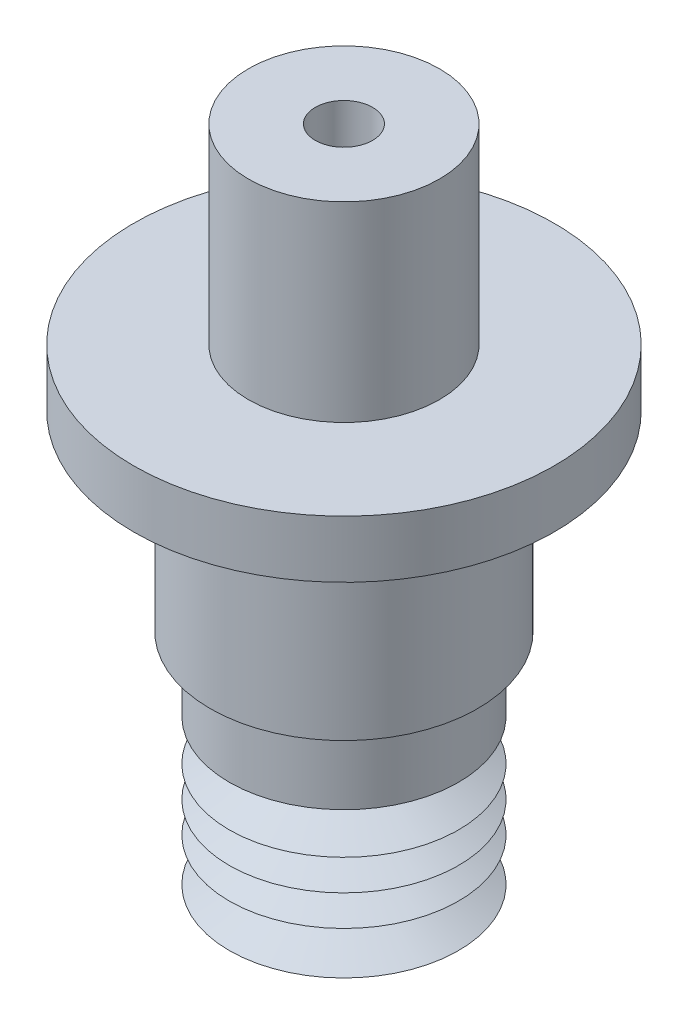
ISO-10303-21;
HEADER;
FILE_DESCRIPTION(('STEP AP214'),'2;1');
FILE_NAME('part.step','',(''),(''),'','','');
FILE_SCHEMA(('AUTOMOTIVE_DESIGN { 1 0 10303 214 1 1 1 1 }'));
ENDSEC;
DATA;
#1=APPLICATION_CONTEXT('core data for automotive mechanical design processes');
#2=APPLICATION_PROTOCOL_DEFINITION('international standard','automotive_design',2000,#1);
#3=PRODUCT_CONTEXT('',#1,'mechanical');
#4=PRODUCT('Part','Part','',(#3));
#5=PRODUCT_RELATED_PRODUCT_CATEGORY('part','',(#4));
#6=PRODUCT_DEFINITION_FORMATION('','',#4);
#7=PRODUCT_DEFINITION_CONTEXT('part definition',#1,'design');
#8=PRODUCT_DEFINITION('design','',#6,#7);
#9=PRODUCT_DEFINITION_SHAPE('','',#8);
#10=(LENGTH_UNIT() NAMED_UNIT(*) SI_UNIT(.MILLI.,.METRE.));
#11=(NAMED_UNIT(*) PLANE_ANGLE_UNIT() SI_UNIT($,.RADIAN.));
#12=(NAMED_UNIT(*) SI_UNIT($,.STERADIAN.) SOLID_ANGLE_UNIT());
#13=UNCERTAINTY_MEASURE_WITH_UNIT(LENGTH_MEASURE(1.E-05),#10,'distance_accuracy_value','');
#14=(GEOMETRIC_REPRESENTATION_CONTEXT(3) GLOBAL_UNCERTAINTY_ASSIGNED_CONTEXT((#13)) GLOBAL_UNIT_ASSIGNED_CONTEXT((#10,
#11,#12)) REPRESENTATION_CONTEXT('',''));
#15=CARTESIAN_POINT('',(0.,0.,0.));
#16=DIRECTION('',(0.,0.,1.));
#17=DIRECTION('',(1.,0.,0.));
#18=AXIS2_PLACEMENT_3D('',#15,#16,#17);
#19=CARTESIAN_POINT('',(0.,-3.06123305752487,0.));
#20=DIRECTION('',(0.,-1.,0.));
#21=DIRECTION('',(0.,0.,-1.));
#22=AXIS2_PLACEMENT_3D('',#19,#20,#21);
#23=CONICAL_SURFACE('',#22,4.06143498969451,1.11982088644156);
#24=CARTESIAN_POINT('',(0.,-3.99999999999068,0.));
#25=DIRECTION('',(0.,1.,0.));
#26=DIRECTION('',(0.,0.,1.));
#27=AXIS2_PLACEMENT_3D('',#24,#25,#26);
#28=CIRCLE('',#27,6.0000000000382);
#29=CARTESIAN_POINT('',(0.,-3.99999999999068,6.0000000000382));
#30=VERTEX_POINT('',#29);
#31=EDGE_CURVE('E60',#30,#30,#28,.T.);
#32=ORIENTED_EDGE('',*,*,#31,.T.);
#33=EDGE_LOOP('',(#32));
#34=FACE_BOUND('',#33,.T.);
#35=CARTESIAN_POINT('',(0.,-3.06123305752487,0.));
#36=DIRECTION('',(0.,1.,0.));
#37=DIRECTION('',(0.,0.,1.));
#38=AXIS2_PLACEMENT_3D('',#35,#36,#37);
#39=CIRCLE('',#38,4.06143498969451);
#40=CARTESIAN_POINT('',(0.,-3.06123305752487,4.06143498969451));
#41=VERTEX_POINT('',#40);
#42=EDGE_CURVE('E34',#41,#41,#39,.T.);
#43=ORIENTED_EDGE('',*,*,#42,.F.);
#44=EDGE_LOOP('',(#43));
#45=FACE_BOUND('',#44,.T.);
#46=ADVANCED_FACE('F31',(#34,#45),#23,.T.);
#47=CARTESIAN_POINT('',(0.,-1.75610447428198,0.));
#48=DIRECTION('',(0.,1.,0.));
#49=DIRECTION('',(0.,0.,1.));
#50=AXIS2_PLACEMENT_3D('',#47,#48,#49);
#51=CONICAL_SURFACE('',#50,6.0000000000382,0.978253528230279);
#52=ORIENTED_EDGE('',*,*,#42,.T.);
#53=EDGE_LOOP('',(#52));
#54=FACE_BOUND('',#53,.T.);
#55=CARTESIAN_POINT('',(0.,-1.75610447428198,0.));
#56=DIRECTION('',(0.,1.,0.));
#57=DIRECTION('',(0.,0.,1.));
#58=AXIS2_PLACEMENT_3D('',#55,#56,#57);
#59=CIRCLE('',#58,6.0000000000382);
#60=CARTESIAN_POINT('',(0.,-1.75610447428198,6.0000000000382));
#61=VERTEX_POINT('',#60);
#62=EDGE_CURVE('E42',#61,#61,#59,.T.);
#63=ORIENTED_EDGE('',*,*,#62,.F.);
#64=EDGE_LOOP('',(#63));
#65=FACE_BOUND('',#64,.T.);
#66=ADVANCED_FACE('F124',(#54,#65),#51,.T.);
#67=CARTESIAN_POINT('',(0.,-0.817337531841333,0.));
#68=DIRECTION('',(0.,-1.,0.));
#69=DIRECTION('',(0.,0.,-1.));
#70=AXIS2_PLACEMENT_3D('',#67,#68,#69);
#71=CONICAL_SURFACE('',#70,4.06143498969451,1.11982088645207);
#72=ORIENTED_EDGE('',*,*,#62,.T.);
#73=EDGE_LOOP('',(#72));
#74=FACE_BOUND('',#73,.T.);
#75=CARTESIAN_POINT('',(0.,-0.817337531841333,0.));
#76=DIRECTION('',(0.,1.,0.));
#77=DIRECTION('',(0.,0.,1.));
#78=AXIS2_PLACEMENT_3D('',#75,#76,#77);
#79=CIRCLE('',#78,4.06143498969451);
#80=CARTESIAN_POINT('',(0.,-0.817337531841333,4.06143498969451));
#81=VERTEX_POINT('',#80);
#82=EDGE_CURVE('E116',#81,#81,#79,.T.);
#83=ORIENTED_EDGE('',*,*,#82,.F.);
#84=EDGE_LOOP('',(#83));
#85=FACE_BOUND('',#84,.T.);
#86=ADVANCED_FACE('F121',(#74,#85),#71,.T.);
#87=CARTESIAN_POINT('',(0.,-0.143736576685401,0.));
#88=DIRECTION('',(0.,1.,0.));
#89=DIRECTION('',(0.,0.,1.));
#90=AXIS2_PLACEMENT_3D('',#87,#88,#89);
#91=CONICAL_SURFACE('',#90,6.0000000000382,1.23637360376424);
#92=ORIENTED_EDGE('',*,*,#82,.T.);
#93=EDGE_LOOP('',(#92));
#94=FACE_BOUND('',#93,.T.);
#95=CARTESIAN_POINT('',(0.,-0.143736576685401,0.));
#96=DIRECTION('',(0.,1.,0.));
#97=DIRECTION('',(0.,0.,1.));
#98=AXIS2_PLACEMENT_3D('',#95,#96,#97);
#99=CIRCLE('',#98,6.0000000000382);
#100=CARTESIAN_POINT('',(0.,-0.143736576685401,6.0000000000382));
#101=VERTEX_POINT('',#100);
#102=EDGE_CURVE('E113',#101,#101,#99,.T.);
#103=ORIENTED_EDGE('',*,*,#102,.F.);
#104=EDGE_LOOP('',(#103));
#105=FACE_BOUND('',#104,.T.);
#106=ADVANCED_FACE('F131',(#94,#105),#91,.T.);
#107=CARTESIAN_POINT('',(0.,0.795030365780429,0.));
#108=DIRECTION('',(0.,-1.,0.));
#109=DIRECTION('',(0.,0.,-1.));
#110=AXIS2_PLACEMENT_3D('',#107,#108,#109);
#111=CONICAL_SURFACE('',#110,4.06143498969451,1.11982088644155);
#112=ORIENTED_EDGE('',*,*,#102,.T.);
#113=EDGE_LOOP('',(#112));
#114=FACE_BOUND('',#113,.T.);
#115=CARTESIAN_POINT('',(0.,0.795030365780429,0.));
#116=DIRECTION('',(0.,1.,0.));
#117=DIRECTION('',(0.,0.,1.));
#118=AXIS2_PLACEMENT_3D('',#115,#116,#117);
#119=CIRCLE('',#118,4.06143498969451);
#120=CARTESIAN_POINT('',(0.,0.795030365780429,4.06143498969451));
#121=VERTEX_POINT('',#120);
#122=EDGE_CURVE('E110',#121,#121,#119,.T.);
#123=ORIENTED_EDGE('',*,*,#122,.F.);
#124=EDGE_LOOP('',(#123));
#125=FACE_BOUND('',#124,.T.);
#126=ADVANCED_FACE('F137',(#114,#125),#111,.T.);
#127=CARTESIAN_POINT('',(0.,1.46863132093602,0.));
#128=DIRECTION('',(0.,1.,0.));
#129=DIRECTION('',(0.,0.,1.));
#130=AXIS2_PLACEMENT_3D('',#127,#128,#129);
#131=CONICAL_SURFACE('',#130,6.0000000000382,1.2363736037644);
#132=ORIENTED_EDGE('',*,*,#122,.T.);
#133=EDGE_LOOP('',(#132));
#134=FACE_BOUND('',#133,.T.);
#135=CARTESIAN_POINT('',(0.,1.46863132093602,0.));
#136=DIRECTION('',(0.,1.,0.));
#137=DIRECTION('',(0.,0.,1.));
#138=AXIS2_PLACEMENT_3D('',#135,#136,#137);
#139=CIRCLE('',#138,6.0000000000382);
#140=CARTESIAN_POINT('',(0.,1.46863132093602,6.0000000000382));
#141=VERTEX_POINT('',#140);
#142=EDGE_CURVE('E107',#141,#141,#139,.T.);
#143=ORIENTED_EDGE('',*,*,#142,.F.);
#144=EDGE_LOOP('',(#143));
#145=FACE_BOUND('',#144,.T.);
#146=ADVANCED_FACE('F141',(#134,#145),#131,.T.);
#147=CARTESIAN_POINT('',(0.,2.40739826340219,0.));
#148=DIRECTION('',(0.,-1.,0.));
#149=DIRECTION('',(0.,0.,-1.));
#150=AXIS2_PLACEMENT_3D('',#147,#148,#149);
#151=CONICAL_SURFACE('',#150,4.06143498969451,1.11982088644141);
#152=ORIENTED_EDGE('',*,*,#142,.T.);
#153=EDGE_LOOP('',(#152));
#154=FACE_BOUND('',#153,.T.);
#155=CARTESIAN_POINT('',(0.,2.40739826340219,0.));
#156=DIRECTION('',(0.,1.,0.));
#157=DIRECTION('',(0.,0.,1.));
#158=AXIS2_PLACEMENT_3D('',#155,#156,#157);
#159=CIRCLE('',#158,4.06143498969451);
#160=CARTESIAN_POINT('',(0.,2.40739826340219,4.06143498969451));
#161=VERTEX_POINT('',#160);
#162=EDGE_CURVE('E104',#161,#161,#159,.T.);
#163=ORIENTED_EDGE('',*,*,#162,.F.);
#164=EDGE_LOOP('',(#163));
#165=FACE_BOUND('',#164,.T.);
#166=ADVANCED_FACE('F145',(#154,#165),#151,.T.);
#167=CARTESIAN_POINT('',(0.,3.62568169115654,0.));
#168=DIRECTION('',(0.,1.,0.));
#169=DIRECTION('',(0.,0.,1.));
#170=AXIS2_PLACEMENT_3D('',#167,#168,#169);
#171=CONICAL_SURFACE('',#170,6.,1.00972282548917);
#172=ORIENTED_EDGE('',*,*,#162,.T.);
#173=EDGE_LOOP('',(#172));
#174=FACE_BOUND('',#173,.T.);
#175=CARTESIAN_POINT('',(0.,3.62568169115654,0.));
#176=DIRECTION('',(0.,1.,0.));
#177=DIRECTION('',(0.,0.,1.));
#178=AXIS2_PLACEMENT_3D('',#175,#176,#177);
#179=CIRCLE('',#178,6.);
#180=CARTESIAN_POINT('',(0.,3.62568169115654,6.));
#181=VERTEX_POINT('',#180);
#182=EDGE_CURVE('E101',#181,#181,#179,.T.);
#183=ORIENTED_EDGE('',*,*,#182,.F.);
#184=EDGE_LOOP('',(#183));
#185=FACE_BOUND('',#184,.T.);
#186=ADVANCED_FACE('F149',(#174,#185),#171,.T.);
#187=CARTESIAN_POINT('',(0.,-3.99999999999068,0.));
#188=DIRECTION('',(0.,1.,0.));
#189=DIRECTION('',(0.,0.,1.));
#190=AXIS2_PLACEMENT_3D('',#187,#188,#189);
#191=CYLINDRICAL_SURFACE('',#190,6.);
#192=ORIENTED_EDGE('',*,*,#182,.T.);
#193=EDGE_LOOP('',(#192));
#194=FACE_BOUND('',#193,.T.);
#195=CARTESIAN_POINT('',(0.,7.46513332594373,0.));
#196=DIRECTION('',(0.,1.,0.));
#197=DIRECTION('',(0.,0.,1.));
#198=AXIS2_PLACEMENT_3D('',#195,#196,#197);
#199=CIRCLE('',#198,6.);
#200=CARTESIAN_POINT('',(0.,7.46513332594373,6.));
#201=VERTEX_POINT('',#200);
#202=EDGE_CURVE('E96',#201,#201,#199,.T.);
#203=ORIENTED_EDGE('',*,*,#202,.F.);
#204=EDGE_LOOP('',(#203));
#205=FACE_BOUND('',#204,.T.);
#206=ADVANCED_FACE('F153',(#194,#205),#191,.T.);
#207=CARTESIAN_POINT('',(0.,-3.99999999999068,0.));
#208=DIRECTION('',(0.,1.,0.));
#209=DIRECTION('',(0.,0.,1.));
#210=AXIS2_PLACEMENT_3D('',#207,#208,#209);
#211=CYLINDRICAL_SURFACE('',#210,2.);
#212=CARTESIAN_POINT('',(0.,7.46513332594373,0.));
#213=DIRECTION('',(0.,1.,0.));
#214=DIRECTION('',(0.,0.,1.));
#215=AXIS2_PLACEMENT_3D('',#212,#213,#214);
#216=CIRCLE('',#215,2.);
#217=CARTESIAN_POINT('',(0.,7.46513332594373,2.));
#218=VERTEX_POINT('',#217);
#219=EDGE_CURVE('E57',#218,#218,#216,.T.);
#220=ORIENTED_EDGE('',*,*,#219,.T.);
#221=EDGE_LOOP('',(#220));
#222=FACE_BOUND('',#221,.T.);
#223=CARTESIAN_POINT('',(0.,6.46513332594194,0.));
#224=DIRECTION('',(0.,1.,0.));
#225=DIRECTION('',(0.,0.,1.));
#226=AXIS2_PLACEMENT_3D('',#223,#224,#225);
#227=CIRCLE('',#226,2.);
#228=CARTESIAN_POINT('',(0.,6.46513332594194,2.));
#229=VERTEX_POINT('',#228);
#230=EDGE_CURVE('E93',#229,#229,#227,.T.);
#231=ORIENTED_EDGE('',*,*,#230,.F.);
#232=EDGE_LOOP('',(#231));
#233=FACE_BOUND('',#232,.T.);
#234=ADVANCED_FACE('F157',(#222,#233),#211,.F.);
#235=CARTESIAN_POINT('',(5.,6.46513332594194,0.));
#236=DIRECTION('',(0.,-1.,0.));
#237=DIRECTION('',(0.,0.,-1.));
#238=AXIS2_PLACEMENT_3D('',#235,#236,#237);
#239=PLANE('',#238);
#240=ORIENTED_EDGE('',*,*,#230,.T.);
#241=EDGE_LOOP('',(#240));
#242=FACE_BOUND('',#241,.T.);
#243=CARTESIAN_POINT('',(0.,6.46513332594194,0.));
#244=DIRECTION('',(0.,1.,0.));
#245=DIRECTION('',(0.,0.,1.));
#246=AXIS2_PLACEMENT_3D('',#243,#244,#245);
#247=CIRCLE('',#246,5.);
#248=CARTESIAN_POINT('',(0.,6.46513332594194,5.));
#249=VERTEX_POINT('',#248);
#250=EDGE_CURVE('E90',#249,#249,#247,.T.);
#251=ORIENTED_EDGE('',*,*,#250,.F.);
#252=EDGE_LOOP('',(#251));
#253=FACE_BOUND('',#252,.T.);
#254=ADVANCED_FACE('F161',(#242,#253),#239,.T.);
#255=CARTESIAN_POINT('',(0.,-3.99999999999068,0.));
#256=DIRECTION('',(0.,1.,0.));
#257=DIRECTION('',(0.,0.,1.));
#258=AXIS2_PLACEMENT_3D('',#255,#256,#257);
#259=CYLINDRICAL_SURFACE('',#258,5.);
#260=ORIENTED_EDGE('',*,*,#250,.T.);
#261=EDGE_LOOP('',(#260));
#262=FACE_BOUND('',#261,.T.);
#263=CARTESIAN_POINT('',(0.,4.17831332373515,0.));
#264=DIRECTION('',(0.,1.,0.));
#265=DIRECTION('',(0.,0.,1.));
#266=AXIS2_PLACEMENT_3D('',#263,#264,#265);
#267=CIRCLE('',#266,5.);
#268=CARTESIAN_POINT('',(0.,4.17831332373515,5.));
#269=VERTEX_POINT('',#268);
#270=EDGE_CURVE('E87',#269,#269,#267,.T.);
#271=ORIENTED_EDGE('',*,*,#270,.F.);
#272=EDGE_LOOP('',(#271));
#273=FACE_BOUND('',#272,.T.);
#274=ADVANCED_FACE('F165',(#262,#273),#259,.F.);
#275=CARTESIAN_POINT('',(0.,2.29388309413244,0.));
#276=DIRECTION('',(0.,1.,0.));
#277=DIRECTION('',(0.,0.,1.));
#278=AXIS2_PLACEMENT_3D('',#275,#276,#277);
#279=CONICAL_SURFACE('',#278,2.00144447158455,1.00972282548916);
#280=ORIENTED_EDGE('',*,*,#270,.T.);
#281=EDGE_LOOP('',(#280));
#282=FACE_BOUND('',#281,.T.);
#283=CARTESIAN_POINT('',(0.,2.29388309413244,0.));
#284=DIRECTION('',(0.,1.,0.));
#285=DIRECTION('',(0.,0.,1.));
#286=AXIS2_PLACEMENT_3D('',#283,#284,#285);
#287=CIRCLE('',#286,2.00144447158455);
#288=CARTESIAN_POINT('',(0.,2.29388309413244,2.00144447158455));
#289=VERTEX_POINT('',#288);
#290=EDGE_CURVE('E84',#289,#289,#287,.T.);
#291=ORIENTED_EDGE('',*,*,#290,.F.);
#292=EDGE_LOOP('',(#291));
#293=FACE_BOUND('',#292,.T.);
#294=ADVANCED_FACE('F169',(#282,#293),#279,.F.);
#295=CARTESIAN_POINT('',(0.,1.62082860364697,0.));
#296=DIRECTION('',(0.,-1.,0.));
#297=DIRECTION('',(0.,0.,-1.));
#298=AXIS2_PLACEMENT_3D('',#295,#296,#297);
#299=CONICAL_SURFACE('',#298,3.39131007747074,1.11982088643144);
#300=ORIENTED_EDGE('',*,*,#290,.T.);
#301=EDGE_LOOP('',(#300));
#302=FACE_BOUND('',#301,.T.);
#303=CARTESIAN_POINT('',(0.,1.62082860364697,0.));
#304=DIRECTION('',(0.,1.,0.));
#305=DIRECTION('',(0.,0.,1.));
#306=AXIS2_PLACEMENT_3D('',#303,#304,#305);
#307=CIRCLE('',#306,3.39131007747074);
#308=CARTESIAN_POINT('',(0.,1.62082860364697,3.39131007747074));
#309=VERTEX_POINT('',#308);
#310=EDGE_CURVE('E81',#309,#309,#307,.T.);
#311=ORIENTED_EDGE('',*,*,#310,.F.);
#312=EDGE_LOOP('',(#311));
#313=FACE_BOUND('',#312,.T.);
#314=ADVANCED_FACE('F173',(#302,#313),#299,.F.);
#315=CARTESIAN_POINT('',(0.,0.947227648495368,0.));
#316=DIRECTION('',(0.,1.,0.));
#317=DIRECTION('',(0.,0.,1.));
#318=AXIS2_PLACEMENT_3D('',#315,#316,#317);
#319=CONICAL_SURFACE('',#318,1.4527450671702,1.23637360375933);
#320=ORIENTED_EDGE('',*,*,#310,.T.);
#321=EDGE_LOOP('',(#320));
#322=FACE_BOUND('',#321,.T.);
#323=CARTESIAN_POINT('',(0.,0.947227648495368,0.));
#324=DIRECTION('',(0.,1.,0.));
#325=DIRECTION('',(0.,0.,1.));
#326=AXIS2_PLACEMENT_3D('',#323,#324,#325);
#327=CIRCLE('',#326,1.4527450671702);
#328=CARTESIAN_POINT('',(0.,0.947227648495368,1.4527450671702));
#329=VERTEX_POINT('',#328);
#330=EDGE_CURVE('E78',#329,#329,#327,.T.);
#331=ORIENTED_EDGE('',*,*,#330,.F.);
#332=EDGE_LOOP('',(#331));
#333=FACE_BOUND('',#332,.T.);
#334=ADVANCED_FACE('F177',(#322,#333),#319,.F.);
#335=CARTESIAN_POINT('',(0.,0.00846070602554799,0.));
#336=DIRECTION('',(0.,-1.,0.));
#337=DIRECTION('',(0.,0.,-1.));
#338=AXIS2_PLACEMENT_3D('',#335,#336,#337);
#339=CONICAL_SURFACE('',#338,3.39131007747073,1.11982088643115);
#340=ORIENTED_EDGE('',*,*,#330,.T.);
#341=EDGE_LOOP('',(#340));
#342=FACE_BOUND('',#341,.T.);
#343=CARTESIAN_POINT('',(0.,0.00846070602554799,0.));
#344=DIRECTION('',(0.,1.,0.));
#345=DIRECTION('',(0.,0.,1.));
#346=AXIS2_PLACEMENT_3D('',#343,#344,#345);
#347=CIRCLE('',#346,3.39131007747073);
#348=CARTESIAN_POINT('',(0.,0.00846070602554799,3.39131007747073));
#349=VERTEX_POINT('',#348);
#350=EDGE_CURVE('E75',#349,#349,#347,.T.);
#351=ORIENTED_EDGE('',*,*,#350,.F.);
#352=EDGE_LOOP('',(#351));
#353=FACE_BOUND('',#352,.T.);
#354=ADVANCED_FACE('F181',(#342,#353),#339,.F.);
#355=CARTESIAN_POINT('',(0.,-0.665140249126396,0.));
#356=DIRECTION('',(0.,1.,0.));
#357=DIRECTION('',(0.,0.,1.));
#358=AXIS2_PLACEMENT_3D('',#355,#356,#357);
#359=CONICAL_SURFACE('',#358,1.45274506717019,1.23637360375918);
#360=ORIENTED_EDGE('',*,*,#350,.T.);
#361=EDGE_LOOP('',(#360));
#362=FACE_BOUND('',#361,.T.);
#363=CARTESIAN_POINT('',(0.,-0.665140249126396,0.));
#364=DIRECTION('',(0.,1.,0.));
#365=DIRECTION('',(0.,0.,1.));
#366=AXIS2_PLACEMENT_3D('',#363,#364,#365);
#367=CIRCLE('',#366,1.45274506717019);
#368=CARTESIAN_POINT('',(0.,-0.665140249126396,1.45274506717019));
#369=VERTEX_POINT('',#368);
#370=EDGE_CURVE('E72',#369,#369,#367,.T.);
#371=ORIENTED_EDGE('',*,*,#370,.F.);
#372=EDGE_LOOP('',(#371));
#373=FACE_BOUND('',#372,.T.);
#374=ADVANCED_FACE('F185',(#362,#373),#359,.F.);
#375=CARTESIAN_POINT('',(0.,-1.89800603746448,0.));
#376=DIRECTION('',(0.,-1.,0.));
#377=DIRECTION('',(0.,0.,-1.));
#378=AXIS2_PLACEMENT_3D('',#375,#376,#377);
#379=CONICAL_SURFACE('',#378,3.99862772617144,1.11982088643258);
#380=ORIENTED_EDGE('',*,*,#370,.T.);
#381=EDGE_LOOP('',(#380));
#382=FACE_BOUND('',#381,.T.);
#383=CARTESIAN_POINT('',(0.,-1.89800603746448,0.));
#384=DIRECTION('',(0.,1.,0.));
#385=DIRECTION('',(0.,0.,1.));
#386=AXIS2_PLACEMENT_3D('',#383,#384,#385);
#387=CIRCLE('',#386,3.99862772617144);
#388=CARTESIAN_POINT('',(0.,-1.89800603746448,3.99862772617144));
#389=VERTEX_POINT('',#388);
#390=EDGE_CURVE('E69',#389,#389,#387,.T.);
#391=ORIENTED_EDGE('',*,*,#390,.F.);
#392=EDGE_LOOP('',(#391));
#393=FACE_BOUND('',#392,.T.);
#394=ADVANCED_FACE('F189',(#382,#393),#379,.F.);
#395=CARTESIAN_POINT('',(0.,-3.20313462069293,0.));
#396=DIRECTION('',(0.,1.,0.));
#397=DIRECTION('',(0.,0.,1.));
#398=AXIS2_PLACEMENT_3D('',#395,#396,#397);
#399=CONICAL_SURFACE('',#398,2.06006271589014,0.978253528220493);
#400=ORIENTED_EDGE('',*,*,#390,.T.);
#401=EDGE_LOOP('',(#400));
#402=FACE_BOUND('',#401,.T.);
#403=CARTESIAN_POINT('',(0.,-3.20313462069293,0.));
#404=DIRECTION('',(0.,1.,0.));
#405=DIRECTION('',(0.,0.,1.));
#406=AXIS2_PLACEMENT_3D('',#403,#404,#405);
#407=CIRCLE('',#406,2.06006271589014);
#408=CARTESIAN_POINT('',(0.,-3.20313462069293,2.06006271589014));
#409=VERTEX_POINT('',#408);
#410=EDGE_CURVE('E66',#409,#409,#407,.T.);
#411=ORIENTED_EDGE('',*,*,#410,.F.);
#412=EDGE_LOOP('',(#411));
#413=FACE_BOUND('',#412,.T.);
#414=ADVANCED_FACE('F193',(#402,#413),#399,.F.);
#415=CARTESIAN_POINT('',(0.,-3.99999999999068,0.));
#416=DIRECTION('',(0.,-1.,0.));
#417=DIRECTION('',(0.,0.,-1.));
#418=AXIS2_PLACEMENT_3D('',#415,#416,#417);
#419=CONICAL_SURFACE('',#418,3.70559929406045,1.11982088642727);
#420=ORIENTED_EDGE('',*,*,#410,.T.);
#421=EDGE_LOOP('',(#420));
#422=FACE_BOUND('',#421,.T.);
#423=CARTESIAN_POINT('',(0.,-3.99999999999068,0.));
#424=DIRECTION('',(0.,1.,0.));
#425=DIRECTION('',(0.,0.,1.));
#426=AXIS2_PLACEMENT_3D('',#423,#424,#425);
#427=CIRCLE('',#426,3.70559929406045);
#428=CARTESIAN_POINT('',(0.,-3.99999999999068,3.70559929406045));
#429=VERTEX_POINT('',#428);
#430=EDGE_CURVE('E63',#429,#429,#427,.T.);
#431=ORIENTED_EDGE('',*,*,#430,.F.);
#432=EDGE_LOOP('',(#431));
#433=FACE_BOUND('',#432,.T.);
#434=ADVANCED_FACE('F197',(#422,#433),#419,.F.);
#435=CARTESIAN_POINT('',(6.0000000000382,-3.99999999999068,0.));
#436=DIRECTION('',(0.,-1.,0.));
#437=DIRECTION('',(0.,0.,-1.));
#438=AXIS2_PLACEMENT_3D('',#435,#436,#437);
#439=PLANE('',#438);
#440=ORIENTED_EDGE('',*,*,#430,.T.);
#441=EDGE_LOOP('',(#440));
#442=FACE_BOUND('',#441,.T.);
#443=ORIENTED_EDGE('',*,*,#31,.F.);
#444=EDGE_LOOP('',(#443));
#445=FACE_BOUND('',#444,.T.);
#446=ADVANCED_FACE('F201',(#442,#445),#439,.T.);
#447=CARTESIAN_POINT('',(0.,7.46513332594373,0.));
#448=DIRECTION('',(0.,1.,0.));
#449=DIRECTION('',(0.,0.,1.));
#450=AXIS2_PLACEMENT_3D('',#447,#448,#449);
#451=PLANE('',#450);
#452=ORIENTED_EDGE('',*,*,#219,.F.);
#453=EDGE_LOOP('',(#452));
#454=FACE_BOUND('',#453,.T.);
#455=ADVANCED_FACE('F205',(#454),#451,.F.);
#456=CARTESIAN_POINT('',(0.,17.4651333259437,0.));
#457=DIRECTION('',(0.,-1.,0.));
#458=DIRECTION('',(0.,0.,-1.));
#459=AXIS2_PLACEMENT_3D('',#456,#457,#458);
#460=CYLINDRICAL_SURFACE('',#459,7.);
#461=CARTESIAN_POINT('',(0.,17.4651333259437,0.));
#462=DIRECTION('',(0.,1.,0.));
#463=DIRECTION('',(0.,0.,1.));
#464=AXIS2_PLACEMENT_3D('',#461,#462,#463);
#465=CIRCLE('',#464,7.);
#466=CARTESIAN_POINT('',(0.,17.4651333259437,7.));
#467=VERTEX_POINT('',#466);
#468=EDGE_CURVE('E54',#467,#467,#465,.T.);
#469=ORIENTED_EDGE('',*,*,#468,.F.);
#470=EDGE_LOOP('',(#469));
#471=FACE_BOUND('',#470,.T.);
#472=CARTESIAN_POINT('',(0.,7.46513332594373,0.));
#473=DIRECTION('',(0.,1.,0.));
#474=DIRECTION('',(0.,0.,1.));
#475=AXIS2_PLACEMENT_3D('',#472,#473,#474);
#476=CIRCLE('',#475,7.);
#477=CARTESIAN_POINT('',(0.,7.46513332594373,7.));
#478=VERTEX_POINT('',#477);
#479=EDGE_CURVE('E50',#478,#478,#476,.T.);
#480=ORIENTED_EDGE('',*,*,#479,.T.);
#481=EDGE_LOOP('',(#480));
#482=FACE_BOUND('',#481,.T.);
#483=ADVANCED_FACE('F207',(#471,#482),#460,.T.);
#484=ORIENTED_EDGE('',*,*,#202,.T.);
#485=EDGE_LOOP('',(#484));
#486=FACE_BOUND('',#485,.T.);
#487=ORIENTED_EDGE('',*,*,#479,.F.);
#488=EDGE_LOOP('',(#487));
#489=FACE_BOUND('',#488,.T.);
#490=ADVANCED_FACE('F210',(#486,#489),#451,.F.);
#491=CARTESIAN_POINT('',(0.,20.4651333259437,0.));
#492=DIRECTION('',(0.,-1.,0.));
#493=DIRECTION('',(0.,0.,-1.));
#494=AXIS2_PLACEMENT_3D('',#491,#492,#493);
#495=CYLINDRICAL_SURFACE('',#494,11.);
#496=CARTESIAN_POINT('',(0.,20.4651333259437,0.));
#497=DIRECTION('',(0.,1.,0.));
#498=DIRECTION('',(0.,0.,1.));
#499=AXIS2_PLACEMENT_3D('',#496,#497,#498);
#500=CIRCLE('',#499,11.);
#501=CARTESIAN_POINT('',(0.,20.4651333259437,11.));
#502=VERTEX_POINT('',#501);
#503=EDGE_CURVE('E47',#502,#502,#500,.T.);
#504=ORIENTED_EDGE('',*,*,#503,.F.);
#505=EDGE_LOOP('',(#504));
#506=FACE_BOUND('',#505,.T.);
#507=CARTESIAN_POINT('',(0.,17.4651333259437,0.));
#508=DIRECTION('',(0.,1.,0.));
#509=DIRECTION('',(0.,0.,1.));
#510=AXIS2_PLACEMENT_3D('',#507,#508,#509);
#511=CIRCLE('',#510,11.);
#512=CARTESIAN_POINT('',(0.,17.4651333259437,11.));
#513=VERTEX_POINT('',#512);
#514=EDGE_CURVE('E51',#513,#513,#511,.T.);
#515=ORIENTED_EDGE('',*,*,#514,.T.);
#516=EDGE_LOOP('',(#515));
#517=FACE_BOUND('',#516,.T.);
#518=ADVANCED_FACE('F214',(#506,#517),#495,.T.);
#519=CARTESIAN_POINT('',(0.,20.4651333259437,0.));
#520=DIRECTION('',(0.,1.,0.));
#521=DIRECTION('',(0.,0.,1.));
#522=AXIS2_PLACEMENT_3D('',#519,#520,#521);
#523=PLANE('',#522);
#524=CARTESIAN_POINT('',(0.,20.4651333259437,0.));
#525=DIRECTION('',(0.,1.,0.));
#526=DIRECTION('',(0.,0.,1.));
#527=AXIS2_PLACEMENT_3D('',#524,#525,#526);
#528=CIRCLE('',#527,5.);
#529=CARTESIAN_POINT('',(0.,20.4651333259437,5.));
#530=VERTEX_POINT('',#529);
#531=EDGE_CURVE('E10',#530,#530,#528,.T.);
#532=ORIENTED_EDGE('',*,*,#531,.F.);
#533=EDGE_LOOP('',(#532));
#534=FACE_BOUND('',#533,.T.);
#535=ORIENTED_EDGE('',*,*,#503,.T.);
#536=EDGE_LOOP('',(#535));
#537=FACE_BOUND('',#536,.T.);
#538=ADVANCED_FACE('F218',(#534,#537),#523,.T.);
#539=CARTESIAN_POINT('',(0.,17.4651333259437,0.));
#540=DIRECTION('',(0.,1.,0.));
#541=DIRECTION('',(0.,0.,1.));
#542=AXIS2_PLACEMENT_3D('',#539,#540,#541);
#543=PLANE('',#542);
#544=ORIENTED_EDGE('',*,*,#468,.T.);
#545=EDGE_LOOP('',(#544));
#546=FACE_BOUND('',#545,.T.);
#547=ORIENTED_EDGE('',*,*,#514,.F.);
#548=EDGE_LOOP('',(#547));
#549=FACE_BOUND('',#548,.T.);
#550=ADVANCED_FACE('F220',(#546,#549),#543,.F.);
#551=CARTESIAN_POINT('',(0.,30.4651333259437,0.));
#552=DIRECTION('',(0.,1.,0.));
#553=DIRECTION('',(0.,0.,1.));
#554=AXIS2_PLACEMENT_3D('',#551,#552,#553);
#555=PLANE('',#554);
#556=CARTESIAN_POINT('',(0.,30.4651333259437,0.));
#557=DIRECTION('',(0.,1.,0.));
#558=DIRECTION('',(0.,0.,1.));
#559=AXIS2_PLACEMENT_3D('',#556,#557,#558);
#560=CIRCLE('',#559,5.);
#561=CARTESIAN_POINT('',(0.,30.4651333259437,5.));
#562=VERTEX_POINT('',#561);
#563=EDGE_CURVE('E45',#562,#562,#560,.T.);
#564=ORIENTED_EDGE('',*,*,#563,.T.);
#565=EDGE_LOOP('',(#564));
#566=FACE_BOUND('',#565,.T.);
#567=CARTESIAN_POINT('',(0.,30.4651333259437,0.));
#568=DIRECTION('',(0.,1.,0.));
#569=DIRECTION('',(0.,0.,1.));
#570=AXIS2_PLACEMENT_3D('',#567,#568,#569);
#571=CIRCLE('',#570,1.5);
#572=CARTESIAN_POINT('',(0.,30.4651333259437,1.5));
#573=VERTEX_POINT('',#572);
#574=EDGE_CURVE('E246',#573,#573,#571,.T.);
#575=ORIENTED_EDGE('',*,*,#574,.F.);
#576=EDGE_LOOP('',(#575));
#577=FACE_BOUND('',#576,.T.);
#578=ADVANCED_FACE('F223',(#566,#577),#555,.T.);
#579=CARTESIAN_POINT('',(0.,30.4651333259437,0.));
#580=DIRECTION('',(0.,-1.,0.));
#581=DIRECTION('',(0.,0.,-1.));
#582=AXIS2_PLACEMENT_3D('',#579,#580,#581);
#583=CYLINDRICAL_SURFACE('',#582,5.);
#584=ORIENTED_EDGE('',*,*,#563,.F.);
#585=EDGE_LOOP('',(#584));
#586=FACE_BOUND('',#585,.T.);
#587=ORIENTED_EDGE('',*,*,#531,.T.);
#588=EDGE_LOOP('',(#587));
#589=FACE_BOUND('',#588,.T.);
#590=ADVANCED_FACE('F229',(#586,#589),#583,.T.);
#591=CARTESIAN_POINT('',(0.,30.4651333259437,0.));
#592=DIRECTION('',(0.,-1.,0.));
#593=DIRECTION('',(0.,0.,-1.));
#594=AXIS2_PLACEMENT_3D('',#591,#592,#593);
#595=CYLINDRICAL_SURFACE('',#594,1.5);
#596=ORIENTED_EDGE('',*,*,#574,.T.);
#597=EDGE_LOOP('',(#596));
#598=FACE_BOUND('',#597,.T.);
#599=CARTESIAN_POINT('',(0.,20.4651333259437,0.));
#600=DIRECTION('',(0.,1.,0.));
#601=DIRECTION('',(0.,0.,1.));
#602=AXIS2_PLACEMENT_3D('',#599,#600,#601);
#603=CIRCLE('',#602,1.5);
#604=CARTESIAN_POINT('',(0.,20.4651333259437,1.5));
#605=VERTEX_POINT('',#604);
#606=EDGE_CURVE('E249',#605,#605,#603,.T.);
#607=ORIENTED_EDGE('',*,*,#606,.F.);
#608=EDGE_LOOP('',(#607));
#609=FACE_BOUND('',#608,.T.);
#610=ADVANCED_FACE('F232',(#598,#609),#595,.F.);
#611=ORIENTED_EDGE('',*,*,#606,.T.);
#612=EDGE_LOOP('',(#611));
#613=FACE_BOUND('',#612,.T.);
#614=ADVANCED_FACE('F228',(#613),#523,.T.);
#615=CLOSED_SHELL('',(#46,#66,#86,#106,#126,#146,#166,#186,#206,#234,#254,#274,#294,#314,#334,
#354,#374,#394,#414,#434,#446,#455,#483,#490,#518,#538,#550,#578,#590,#610,#614));
#616=MANIFOLD_SOLID_BREP('B2',#615);
#617=ADVANCED_BREP_SHAPE_REPRESENTATION('',(#18,#616),#14);
#618=SHAPE_DEFINITION_REPRESENTATION(#9,#617);
ENDSEC;
END-ISO-10303-21;
